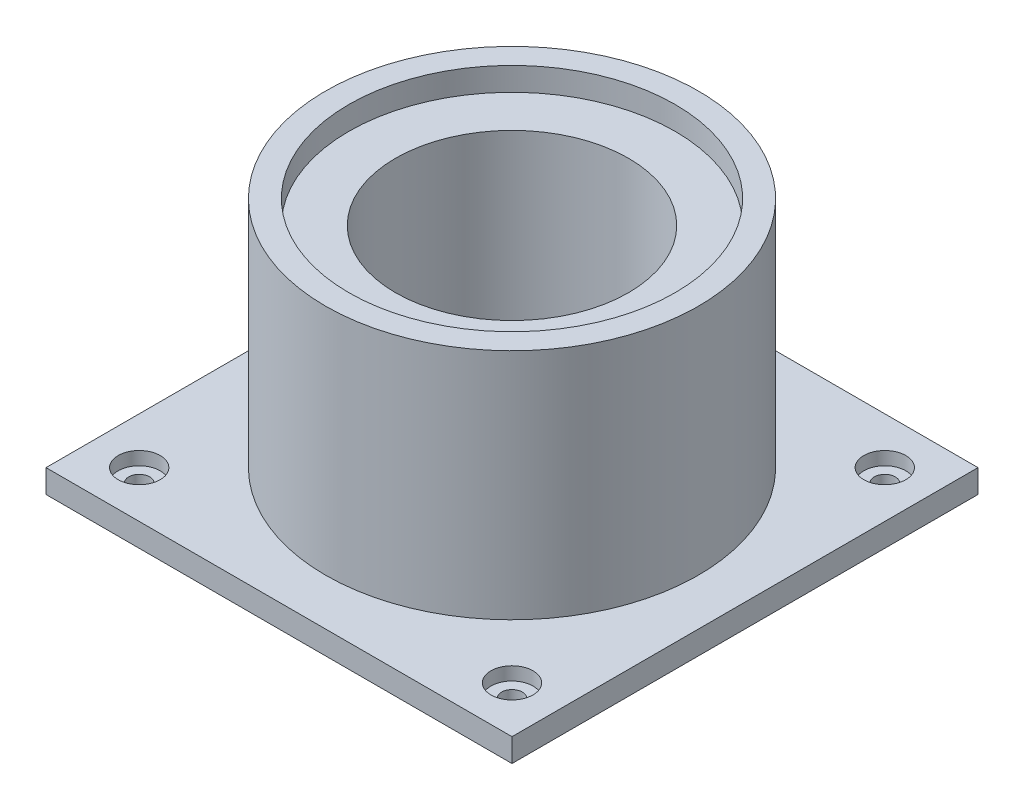
ISO-10303-21;
HEADER;
FILE_DESCRIPTION(('STEP AP214'),'2;1');
FILE_NAME('part.step','',(''),(''),'','','');
FILE_SCHEMA(('AUTOMOTIVE_DESIGN { 1 0 10303 214 1 1 1 1 }'));
ENDSEC;
DATA;
#1=APPLICATION_CONTEXT('core data for automotive mechanical design processes');
#2=APPLICATION_PROTOCOL_DEFINITION('international standard','automotive_design',2000,#1);
#3=PRODUCT_CONTEXT('',#1,'mechanical');
#4=PRODUCT('Part','Part','',(#3));
#5=PRODUCT_RELATED_PRODUCT_CATEGORY('part','',(#4));
#6=PRODUCT_DEFINITION_FORMATION('','',#4);
#7=PRODUCT_DEFINITION_CONTEXT('part definition',#1,'design');
#8=PRODUCT_DEFINITION('design','',#6,#7);
#9=PRODUCT_DEFINITION_SHAPE('','',#8);
#10=(LENGTH_UNIT() NAMED_UNIT(*) SI_UNIT(.MILLI.,.METRE.));
#11=(NAMED_UNIT(*) PLANE_ANGLE_UNIT() SI_UNIT($,.RADIAN.));
#12=(NAMED_UNIT(*) SI_UNIT($,.STERADIAN.) SOLID_ANGLE_UNIT());
#13=UNCERTAINTY_MEASURE_WITH_UNIT(LENGTH_MEASURE(1.E-05),#10,'distance_accuracy_value','');
#14=(GEOMETRIC_REPRESENTATION_CONTEXT(3) GLOBAL_UNCERTAINTY_ASSIGNED_CONTEXT((#13)) GLOBAL_UNIT_ASSIGNED_CONTEXT((#10,
#11,#12)) REPRESENTATION_CONTEXT('',''));
#15=CARTESIAN_POINT('',(0.,0.,0.));
#16=DIRECTION('',(0.,0.,1.));
#17=DIRECTION('',(1.,0.,0.));
#18=AXIS2_PLACEMENT_3D('',#15,#16,#17);
#19=CARTESIAN_POINT('',(-100.,10.,100.));
#20=DIRECTION('',(1.,0.,0.));
#21=DIRECTION('',(0.,0.,-1.));
#22=AXIS2_PLACEMENT_3D('',#19,#20,#21);
#23=PLANE('',#22);
#24=DIRECTION('',(0.,0.,1.));
#25=VECTOR('',#24,1.);
#26=CARTESIAN_POINT('',(-100.,0.,100.));
#27=LINE('',#26,#25);
#28=CARTESIAN_POINT('',(-100.,0.,-100.));
#29=VERTEX_POINT('',#28);
#30=CARTESIAN_POINT('',(-100.,0.,100.));
#31=VERTEX_POINT('',#30);
#32=EDGE_CURVE('E112',#29,#31,#27,.T.);
#33=ORIENTED_EDGE('',*,*,#32,.T.);
#34=DIRECTION('',(0.,-1.,0.));
#35=VECTOR('',#34,1.);
#36=CARTESIAN_POINT('',(-100.,10.,100.));
#37=LINE('',#36,#35);
#38=CARTESIAN_POINT('',(-100.,10.,100.));
#39=VERTEX_POINT('',#38);
#40=EDGE_CURVE('E49',#39,#31,#37,.T.);
#41=ORIENTED_EDGE('',*,*,#40,.F.);
#42=DIRECTION('',(0.,0.,1.));
#43=VECTOR('',#42,1.);
#44=CARTESIAN_POINT('',(-100.,10.,100.));
#45=LINE('',#44,#43);
#46=CARTESIAN_POINT('',(-100.,10.,-100.));
#47=VERTEX_POINT('',#46);
#48=EDGE_CURVE('E94',#47,#39,#45,.T.);
#49=ORIENTED_EDGE('',*,*,#48,.F.);
#50=DIRECTION('',(0.,-1.,0.));
#51=VECTOR('',#50,1.);
#52=CARTESIAN_POINT('',(-100.,10.,-100.));
#53=LINE('',#52,#51);
#54=EDGE_CURVE('E108',#47,#29,#53,.T.);
#55=ORIENTED_EDGE('',*,*,#54,.T.);
#56=EDGE_LOOP('',(#33,#41,#49,#55));
#57=FACE_BOUND('',#56,.T.);
#58=ADVANCED_FACE('F39',(#57),#23,.F.);
#59=CARTESIAN_POINT('',(100.,10.,100.));
#60=DIRECTION('',(0.,0.,-1.));
#61=DIRECTION('',(-1.,0.,0.));
#62=AXIS2_PLACEMENT_3D('',#59,#60,#61);
#63=PLANE('',#62);
#64=DIRECTION('',(1.,0.,0.));
#65=VECTOR('',#64,1.);
#66=CARTESIAN_POINT('',(100.,0.,100.));
#67=LINE('',#66,#65);
#68=CARTESIAN_POINT('',(100.,0.,100.));
#69=VERTEX_POINT('',#68);
#70=EDGE_CURVE('E100',#31,#69,#67,.T.);
#71=ORIENTED_EDGE('',*,*,#70,.T.);
#72=DIRECTION('',(0.,-1.,0.));
#73=VECTOR('',#72,1.);
#74=CARTESIAN_POINT('',(100.,10.,100.));
#75=LINE('',#74,#73);
#76=CARTESIAN_POINT('',(100.,10.,100.));
#77=VERTEX_POINT('',#76);
#78=EDGE_CURVE('E98',#77,#69,#75,.T.);
#79=ORIENTED_EDGE('',*,*,#78,.F.);
#80=DIRECTION('',(1.,0.,0.));
#81=VECTOR('',#80,1.);
#82=CARTESIAN_POINT('',(100.,10.,100.));
#83=LINE('',#82,#81);
#84=EDGE_CURVE('E89',#39,#77,#83,.T.);
#85=ORIENTED_EDGE('',*,*,#84,.F.);
#86=ORIENTED_EDGE('',*,*,#40,.T.);
#87=EDGE_LOOP('',(#71,#79,#85,#86));
#88=FACE_BOUND('',#87,.T.);
#89=ADVANCED_FACE('F99',(#88),#63,.F.);
#90=CARTESIAN_POINT('',(100.,10.,100.));
#91=DIRECTION('',(-1.,0.,0.));
#92=DIRECTION('',(0.,0.,1.));
#93=AXIS2_PLACEMENT_3D('',#90,#91,#92);
#94=PLANE('',#93);
#95=DIRECTION('',(0.,0.,-1.));
#96=VECTOR('',#95,1.);
#97=CARTESIAN_POINT('',(100.,0.,100.));
#98=LINE('',#97,#96);
#99=CARTESIAN_POINT('',(100.,0.,-100.));
#100=VERTEX_POINT('',#99);
#101=EDGE_CURVE('E75',#69,#100,#98,.T.);
#102=ORIENTED_EDGE('',*,*,#101,.T.);
#103=DIRECTION('',(0.,-1.,0.));
#104=VECTOR('',#103,1.);
#105=CARTESIAN_POINT('',(100.,10.,-100.));
#106=LINE('',#105,#104);
#107=CARTESIAN_POINT('',(100.,10.,-100.));
#108=VERTEX_POINT('',#107);
#109=EDGE_CURVE('E102',#108,#100,#106,.T.);
#110=ORIENTED_EDGE('',*,*,#109,.F.);
#111=DIRECTION('',(0.,0.,-1.));
#112=VECTOR('',#111,1.);
#113=CARTESIAN_POINT('',(100.,10.,100.));
#114=LINE('',#113,#112);
#115=EDGE_CURVE('E92',#77,#108,#114,.T.);
#116=ORIENTED_EDGE('',*,*,#115,.F.);
#117=ORIENTED_EDGE('',*,*,#78,.T.);
#118=EDGE_LOOP('',(#102,#110,#116,#117));
#119=FACE_BOUND('',#118,.T.);
#120=ADVANCED_FACE('F104',(#119),#94,.F.);
#121=CARTESIAN_POINT('',(100.,10.,-100.));
#122=DIRECTION('',(0.,0.,1.));
#123=DIRECTION('',(1.,0.,0.));
#124=AXIS2_PLACEMENT_3D('',#121,#122,#123);
#125=PLANE('',#124);
#126=DIRECTION('',(-1.,0.,0.));
#127=VECTOR('',#126,1.);
#128=CARTESIAN_POINT('',(100.,0.,-100.));
#129=LINE('',#128,#127);
#130=EDGE_CURVE('E81',#100,#29,#129,.T.);
#131=ORIENTED_EDGE('',*,*,#130,.T.);
#132=ORIENTED_EDGE('',*,*,#54,.F.);
#133=DIRECTION('',(-1.,0.,0.));
#134=VECTOR('',#133,1.);
#135=CARTESIAN_POINT('',(100.,10.,-100.));
#136=LINE('',#135,#134);
#137=EDGE_CURVE('E58',#108,#47,#136,.T.);
#138=ORIENTED_EDGE('',*,*,#137,.F.);
#139=ORIENTED_EDGE('',*,*,#109,.T.);
#140=EDGE_LOOP('',(#131,#132,#138,#139));
#141=FACE_BOUND('',#140,.T.);
#142=ADVANCED_FACE('F142',(#141),#125,.F.);
#143=CARTESIAN_POINT('',(0.,10.,0.));
#144=DIRECTION('',(0.,1.,0.));
#145=DIRECTION('',(0.,0.,1.));
#146=AXIS2_PLACEMENT_3D('',#143,#144,#145);
#147=PLANE('',#146);
#148=CARTESIAN_POINT('',(80.,10.,-80.));
#149=DIRECTION('',(0.,1.,0.));
#150=DIRECTION('',(0.,0.,1.));
#151=AXIS2_PLACEMENT_3D('',#148,#149,#150);
#152=CIRCLE('',#151,9.005);
#153=CARTESIAN_POINT('',(80.,10.,-70.995));
#154=VERTEX_POINT('',#153);
#155=EDGE_CURVE('E402',#154,#154,#152,.T.);
#156=ORIENTED_EDGE('',*,*,#155,.F.);
#157=EDGE_LOOP('',(#156));
#158=FACE_BOUND('',#157,.T.);
#159=CARTESIAN_POINT('',(-80.,10.,-80.));
#160=DIRECTION('',(0.,1.,0.));
#161=DIRECTION('',(0.,0.,1.));
#162=AXIS2_PLACEMENT_3D('',#159,#160,#161);
#163=CIRCLE('',#162,9.005);
#164=CARTESIAN_POINT('',(-80.,10.,-70.995));
#165=VERTEX_POINT('',#164);
#166=EDGE_CURVE('E387',#165,#165,#163,.T.);
#167=ORIENTED_EDGE('',*,*,#166,.F.);
#168=EDGE_LOOP('',(#167));
#169=FACE_BOUND('',#168,.T.);
#170=CARTESIAN_POINT('',(80.,10.,80.));
#171=DIRECTION('',(0.,1.,0.));
#172=DIRECTION('',(0.,0.,1.));
#173=AXIS2_PLACEMENT_3D('',#170,#171,#172);
#174=CIRCLE('',#173,9.005);
#175=CARTESIAN_POINT('',(80.,10.,89.005));
#176=VERTEX_POINT('',#175);
#177=EDGE_CURVE('E371',#176,#176,#174,.T.);
#178=ORIENTED_EDGE('',*,*,#177,.F.);
#179=EDGE_LOOP('',(#178));
#180=FACE_BOUND('',#179,.T.);
#181=CARTESIAN_POINT('',(-80.,10.,80.));
#182=DIRECTION('',(0.,1.,0.));
#183=DIRECTION('',(0.,0.,1.));
#184=AXIS2_PLACEMENT_3D('',#181,#182,#183);
#185=CIRCLE('',#184,9.005);
#186=CARTESIAN_POINT('',(-80.,10.,89.005));
#187=VERTEX_POINT('',#186);
#188=EDGE_CURVE('E355',#187,#187,#185,.T.);
#189=ORIENTED_EDGE('',*,*,#188,.F.);
#190=EDGE_LOOP('',(#189));
#191=FACE_BOUND('',#190,.T.);
#192=CARTESIAN_POINT('',(0.,10.,0.));
#193=DIRECTION('',(0.,1.,0.));
#194=DIRECTION('',(0.,0.,1.));
#195=AXIS2_PLACEMENT_3D('',#192,#193,#194);
#196=CIRCLE('',#195,80.);
#197=CARTESIAN_POINT('',(0.,10.,80.));
#198=VERTEX_POINT('',#197);
#199=EDGE_CURVE('E11',#198,#198,#196,.T.);
#200=ORIENTED_EDGE('',*,*,#199,.F.);
#201=EDGE_LOOP('',(#200));
#202=FACE_BOUND('',#201,.T.);
#203=ORIENTED_EDGE('',*,*,#48,.T.);
#204=ORIENTED_EDGE('',*,*,#84,.T.);
#205=ORIENTED_EDGE('',*,*,#115,.T.);
#206=ORIENTED_EDGE('',*,*,#137,.T.);
#207=EDGE_LOOP('',(#203,#204,#205,#206));
#208=FACE_BOUND('',#207,.T.);
#209=ADVANCED_FACE('F90',(#158,#169,#180,#191,#202,#208),#147,.T.);
#210=CARTESIAN_POINT('',(0.,0.,0.));
#211=DIRECTION('',(0.,1.,0.));
#212=DIRECTION('',(0.,0.,1.));
#213=AXIS2_PLACEMENT_3D('',#210,#211,#212);
#214=PLANE('',#213);
#215=CARTESIAN_POINT('',(80.,0.,-80.));
#216=DIRECTION('',(0.,1.,0.));
#217=DIRECTION('',(0.,0.,1.));
#218=AXIS2_PLACEMENT_3D('',#215,#216,#217);
#219=CIRCLE('',#218,4.5);
#220=CARTESIAN_POINT('',(80.,0.,-75.5));
#221=VERTEX_POINT('',#220);
#222=EDGE_CURVE('E391',#221,#221,#219,.T.);
#223=ORIENTED_EDGE('',*,*,#222,.T.);
#224=EDGE_LOOP('',(#223));
#225=FACE_BOUND('',#224,.T.);
#226=CARTESIAN_POINT('',(-80.,0.,-80.));
#227=DIRECTION('',(0.,1.,0.));
#228=DIRECTION('',(0.,0.,1.));
#229=AXIS2_PLACEMENT_3D('',#226,#227,#228);
#230=CIRCLE('',#229,4.5);
#231=CARTESIAN_POINT('',(-80.,0.,-75.5));
#232=VERTEX_POINT('',#231);
#233=EDGE_CURVE('E375',#232,#232,#230,.T.);
#234=ORIENTED_EDGE('',*,*,#233,.T.);
#235=EDGE_LOOP('',(#234));
#236=FACE_BOUND('',#235,.T.);
#237=CARTESIAN_POINT('',(80.,0.,80.));
#238=DIRECTION('',(0.,1.,0.));
#239=DIRECTION('',(0.,0.,1.));
#240=AXIS2_PLACEMENT_3D('',#237,#238,#239);
#241=CIRCLE('',#240,4.5);
#242=CARTESIAN_POINT('',(80.,0.,84.5));
#243=VERTEX_POINT('',#242);
#244=EDGE_CURVE('E359',#243,#243,#241,.T.);
#245=ORIENTED_EDGE('',*,*,#244,.T.);
#246=EDGE_LOOP('',(#245));
#247=FACE_BOUND('',#246,.T.);
#248=CARTESIAN_POINT('',(-80.,0.,80.));
#249=DIRECTION('',(0.,1.,0.));
#250=DIRECTION('',(0.,0.,1.));
#251=AXIS2_PLACEMENT_3D('',#248,#249,#250);
#252=CIRCLE('',#251,4.5);
#253=CARTESIAN_POINT('',(-80.,0.,84.5));
#254=VERTEX_POINT('',#253);
#255=EDGE_CURVE('E340',#254,#254,#252,.T.);
#256=ORIENTED_EDGE('',*,*,#255,.T.);
#257=EDGE_LOOP('',(#256));
#258=FACE_BOUND('',#257,.T.);
#259=ORIENTED_EDGE('',*,*,#32,.F.);
#260=ORIENTED_EDGE('',*,*,#130,.F.);
#261=ORIENTED_EDGE('',*,*,#101,.F.);
#262=ORIENTED_EDGE('',*,*,#70,.F.);
#263=EDGE_LOOP('',(#259,#260,#261,#262));
#264=FACE_BOUND('',#263,.T.);
#265=ADVANCED_FACE('F130',(#225,#236,#247,#258,#264),#214,.F.);
#266=CARTESIAN_POINT('',(0.,110.,0.));
#267=DIRECTION('',(0.,-1.,0.));
#268=DIRECTION('',(0.,0.,-1.));
#269=AXIS2_PLACEMENT_3D('',#266,#267,#268);
#270=CYLINDRICAL_SURFACE('',#269,80.);
#271=CARTESIAN_POINT('',(0.,110.,0.));
#272=DIRECTION('',(0.,1.,0.));
#273=DIRECTION('',(0.,0.,1.));
#274=AXIS2_PLACEMENT_3D('',#271,#272,#273);
#275=CIRCLE('',#274,80.);
#276=CARTESIAN_POINT('',(0.,110.,80.));
#277=VERTEX_POINT('',#276);
#278=EDGE_CURVE('E116',#277,#277,#275,.T.);
#279=ORIENTED_EDGE('',*,*,#278,.F.);
#280=EDGE_LOOP('',(#279));
#281=FACE_BOUND('',#280,.T.);
#282=ORIENTED_EDGE('',*,*,#199,.T.);
#283=EDGE_LOOP('',(#282));
#284=FACE_BOUND('',#283,.T.);
#285=ADVANCED_FACE('F132',(#281,#284),#270,.T.);
#286=CARTESIAN_POINT('',(0.,110.,0.));
#287=DIRECTION('',(0.,1.,0.));
#288=DIRECTION('',(0.,0.,1.));
#289=AXIS2_PLACEMENT_3D('',#286,#287,#288);
#290=PLANE('',#289);
#291=CARTESIAN_POINT('',(0.,110.,0.));
#292=DIRECTION('',(0.,1.,0.));
#293=DIRECTION('',(0.,0.,1.));
#294=AXIS2_PLACEMENT_3D('',#291,#292,#293);
#295=CIRCLE('',#294,70.);
#296=CARTESIAN_POINT('',(0.,110.,70.));
#297=VERTEX_POINT('',#296);
#298=EDGE_CURVE('E326',#297,#297,#295,.T.);
#299=ORIENTED_EDGE('',*,*,#298,.F.);
#300=EDGE_LOOP('',(#299));
#301=FACE_BOUND('',#300,.T.);
#302=ORIENTED_EDGE('',*,*,#278,.T.);
#303=EDGE_LOOP('',(#302));
#304=FACE_BOUND('',#303,.T.);
#305=ADVANCED_FACE('F139',(#301,#304),#290,.T.);
#306=CARTESIAN_POINT('',(0.,100.,0.));
#307=DIRECTION('',(0.,1.,0.));
#308=DIRECTION('',(0.,0.,1.));
#309=AXIS2_PLACEMENT_3D('',#306,#307,#308);
#310=PLANE('',#309);
#311=CARTESIAN_POINT('',(0.,100.,0.));
#312=DIRECTION('',(0.,1.,0.));
#313=DIRECTION('',(0.,0.,1.));
#314=AXIS2_PLACEMENT_3D('',#311,#312,#313);
#315=CIRCLE('',#314,70.);
#316=CARTESIAN_POINT('',(0.,100.,70.));
#317=VERTEX_POINT('',#316);
#318=EDGE_CURVE('E339',#317,#317,#315,.T.);
#319=ORIENTED_EDGE('',*,*,#318,.T.);
#320=EDGE_LOOP('',(#319));
#321=FACE_BOUND('',#320,.T.);
#322=CARTESIAN_POINT('',(0.,100.,0.));
#323=DIRECTION('',(0.,1.,0.));
#324=DIRECTION('',(0.,0.,1.));
#325=AXIS2_PLACEMENT_3D('',#322,#323,#324);
#326=CIRCLE('',#325,50.);
#327=CARTESIAN_POINT('',(0.,100.,50.));
#328=VERTEX_POINT('',#327);
#329=EDGE_CURVE('E42',#328,#328,#326,.F.);
#330=ORIENTED_EDGE('',*,*,#329,.T.);
#331=EDGE_LOOP('',(#330));
#332=FACE_BOUND('',#331,.T.);
#333=ADVANCED_FACE('F305',(#321,#332),#310,.T.);
#334=CARTESIAN_POINT('',(0.,100.,0.));
#335=DIRECTION('',(0.,1.,0.));
#336=DIRECTION('',(0.,0.,1.));
#337=AXIS2_PLACEMENT_3D('',#334,#335,#336);
#338=CYLINDRICAL_SURFACE('',#337,70.);
#339=ORIENTED_EDGE('',*,*,#318,.F.);
#340=EDGE_LOOP('',(#339));
#341=FACE_BOUND('',#340,.T.);
#342=ORIENTED_EDGE('',*,*,#298,.T.);
#343=EDGE_LOOP('',(#342));
#344=FACE_BOUND('',#343,.T.);
#345=ADVANCED_FACE('F308',(#341,#344),#338,.F.);
#346=CARTESIAN_POINT('',(0.,10.,0.));
#347=DIRECTION('',(0.,1.,0.));
#348=DIRECTION('',(0.,0.,1.));
#349=AXIS2_PLACEMENT_3D('',#346,#347,#348);
#350=PLANE('',#349);
#351=CARTESIAN_POINT('',(0.,10.,0.));
#352=DIRECTION('',(0.,1.,0.));
#353=DIRECTION('',(0.,0.,1.));
#354=AXIS2_PLACEMENT_3D('',#351,#352,#353);
#355=CIRCLE('',#354,50.);
#356=CARTESIAN_POINT('',(0.,10.,50.));
#357=VERTEX_POINT('',#356);
#358=EDGE_CURVE('E330',#357,#357,#355,.F.);
#359=ORIENTED_EDGE('',*,*,#358,.F.);
#360=EDGE_LOOP('',(#359));
#361=FACE_BOUND('',#360,.T.);
#362=ADVANCED_FACE('F312',(#361),#350,.T.);
#363=CARTESIAN_POINT('',(0.,-131.42135623731,0.));
#364=DIRECTION('',(0.,1.,0.));
#365=DIRECTION('',(0.,0.,1.));
#366=AXIS2_PLACEMENT_3D('',#363,#364,#365);
#367=CYLINDRICAL_SURFACE('',#366,50.);
#368=ORIENTED_EDGE('',*,*,#358,.T.);
#369=EDGE_LOOP('',(#368));
#370=FACE_BOUND('',#369,.T.);
#371=ORIENTED_EDGE('',*,*,#329,.F.);
#372=EDGE_LOOP('',(#371));
#373=FACE_BOUND('',#372,.T.);
#374=ADVANCED_FACE('F172',(#370,#373),#367,.F.);
#375=CARTESIAN_POINT('',(-80.,10.,80.));
#376=DIRECTION('',(0.,1.,0.));
#377=DIRECTION('',(0.,0.,1.));
#378=AXIS2_PLACEMENT_3D('',#375,#376,#377);
#379=CYLINDRICAL_SURFACE('',#378,4.5);
#380=ORIENTED_EDGE('',*,*,#255,.F.);
#381=EDGE_LOOP('',(#380));
#382=FACE_BOUND('',#381,.T.);
#383=CARTESIAN_POINT('',(-80.,4.32,80.));
#384=DIRECTION('',(0.,1.,0.));
#385=DIRECTION('',(0.,0.,1.));
#386=AXIS2_PLACEMENT_3D('',#383,#384,#385);
#387=CIRCLE('',#386,4.5);
#388=CARTESIAN_POINT('',(-80.,4.32,84.5));
#389=VERTEX_POINT('',#388);
#390=EDGE_CURVE('E347',#389,#389,#387,.T.);
#391=ORIENTED_EDGE('',*,*,#390,.T.);
#392=EDGE_LOOP('',(#391));
#393=FACE_BOUND('',#392,.T.);
#394=ADVANCED_FACE('F182',(#382,#393),#379,.F.);
#395=CARTESIAN_POINT('',(-75.5,4.32,80.));
#396=DIRECTION('',(0.,-1.,0.));
#397=DIRECTION('',(0.,0.,-1.));
#398=AXIS2_PLACEMENT_3D('',#395,#396,#397);
#399=PLANE('',#398);
#400=ORIENTED_EDGE('',*,*,#390,.F.);
#401=EDGE_LOOP('',(#400));
#402=FACE_BOUND('',#401,.T.);
#403=CARTESIAN_POINT('',(-80.,4.32,80.));
#404=DIRECTION('',(0.,1.,0.));
#405=DIRECTION('',(0.,0.,1.));
#406=AXIS2_PLACEMENT_3D('',#403,#404,#405);
#407=CIRCLE('',#406,9.005);
#408=CARTESIAN_POINT('',(-80.,4.32,89.005));
#409=VERTEX_POINT('',#408);
#410=EDGE_CURVE('E351',#409,#409,#407,.T.);
#411=ORIENTED_EDGE('',*,*,#410,.T.);
#412=EDGE_LOOP('',(#411));
#413=FACE_BOUND('',#412,.T.);
#414=ADVANCED_FACE('F187',(#402,#413),#399,.F.);
#415=CARTESIAN_POINT('',(-80.,10.,80.));
#416=DIRECTION('',(0.,1.,0.));
#417=DIRECTION('',(0.,0.,1.));
#418=AXIS2_PLACEMENT_3D('',#415,#416,#417);
#419=CYLINDRICAL_SURFACE('',#418,9.005);
#420=ORIENTED_EDGE('',*,*,#410,.F.);
#421=EDGE_LOOP('',(#420));
#422=FACE_BOUND('',#421,.T.);
#423=ORIENTED_EDGE('',*,*,#188,.T.);
#424=EDGE_LOOP('',(#423));
#425=FACE_BOUND('',#424,.T.);
#426=ADVANCED_FACE('F198',(#422,#425),#419,.F.);
#427=CARTESIAN_POINT('',(80.,10.,80.));
#428=DIRECTION('',(0.,1.,0.));
#429=DIRECTION('',(0.,0.,1.));
#430=AXIS2_PLACEMENT_3D('',#427,#428,#429);
#431=CYLINDRICAL_SURFACE('',#430,4.5);
#432=ORIENTED_EDGE('',*,*,#244,.F.);
#433=EDGE_LOOP('',(#432));
#434=FACE_BOUND('',#433,.T.);
#435=CARTESIAN_POINT('',(80.,4.32,80.));
#436=DIRECTION('',(0.,1.,0.));
#437=DIRECTION('',(0.,0.,1.));
#438=AXIS2_PLACEMENT_3D('',#435,#436,#437);
#439=CIRCLE('',#438,4.5);
#440=CARTESIAN_POINT('',(80.,4.32,84.5));
#441=VERTEX_POINT('',#440);
#442=EDGE_CURVE('E363',#441,#441,#439,.T.);
#443=ORIENTED_EDGE('',*,*,#442,.T.);
#444=EDGE_LOOP('',(#443));
#445=FACE_BOUND('',#444,.T.);
#446=ADVANCED_FACE('F208',(#434,#445),#431,.F.);
#447=CARTESIAN_POINT('',(84.5,4.32,80.));
#448=DIRECTION('',(0.,-1.,0.));
#449=DIRECTION('',(0.,0.,-1.));
#450=AXIS2_PLACEMENT_3D('',#447,#448,#449);
#451=PLANE('',#450);
#452=ORIENTED_EDGE('',*,*,#442,.F.);
#453=EDGE_LOOP('',(#452));
#454=FACE_BOUND('',#453,.T.);
#455=CARTESIAN_POINT('',(80.,4.32,80.));
#456=DIRECTION('',(0.,1.,0.));
#457=DIRECTION('',(0.,0.,1.));
#458=AXIS2_PLACEMENT_3D('',#455,#456,#457);
#459=CIRCLE('',#458,9.005);
#460=CARTESIAN_POINT('',(80.,4.32,89.005));
#461=VERTEX_POINT('',#460);
#462=EDGE_CURVE('E367',#461,#461,#459,.T.);
#463=ORIENTED_EDGE('',*,*,#462,.T.);
#464=EDGE_LOOP('',(#463));
#465=FACE_BOUND('',#464,.T.);
#466=ADVANCED_FACE('F218',(#454,#465),#451,.F.);
#467=CARTESIAN_POINT('',(80.,10.,80.));
#468=DIRECTION('',(0.,1.,0.));
#469=DIRECTION('',(0.,0.,1.));
#470=AXIS2_PLACEMENT_3D('',#467,#468,#469);
#471=CYLINDRICAL_SURFACE('',#470,9.005);
#472=ORIENTED_EDGE('',*,*,#462,.F.);
#473=EDGE_LOOP('',(#472));
#474=FACE_BOUND('',#473,.T.);
#475=ORIENTED_EDGE('',*,*,#177,.T.);
#476=EDGE_LOOP('',(#475));
#477=FACE_BOUND('',#476,.T.);
#478=ADVANCED_FACE('F228',(#474,#477),#471,.F.);
#479=CARTESIAN_POINT('',(-80.,10.,-80.));
#480=DIRECTION('',(0.,1.,0.));
#481=DIRECTION('',(0.,0.,1.));
#482=AXIS2_PLACEMENT_3D('',#479,#480,#481);
#483=CYLINDRICAL_SURFACE('',#482,4.5);
#484=ORIENTED_EDGE('',*,*,#233,.F.);
#485=EDGE_LOOP('',(#484));
#486=FACE_BOUND('',#485,.T.);
#487=CARTESIAN_POINT('',(-80.,4.32,-80.));
#488=DIRECTION('',(0.,1.,0.));
#489=DIRECTION('',(0.,0.,1.));
#490=AXIS2_PLACEMENT_3D('',#487,#488,#489);
#491=CIRCLE('',#490,4.5);
#492=CARTESIAN_POINT('',(-80.,4.32,-75.5));
#493=VERTEX_POINT('',#492);
#494=EDGE_CURVE('E379',#493,#493,#491,.T.);
#495=ORIENTED_EDGE('',*,*,#494,.T.);
#496=EDGE_LOOP('',(#495));
#497=FACE_BOUND('',#496,.T.);
#498=ADVANCED_FACE('F238',(#486,#497),#483,.F.);
#499=CARTESIAN_POINT('',(-75.5,4.32,-80.));
#500=DIRECTION('',(0.,-1.,0.));
#501=DIRECTION('',(0.,0.,-1.));
#502=AXIS2_PLACEMENT_3D('',#499,#500,#501);
#503=PLANE('',#502);
#504=ORIENTED_EDGE('',*,*,#494,.F.);
#505=EDGE_LOOP('',(#504));
#506=FACE_BOUND('',#505,.T.);
#507=CARTESIAN_POINT('',(-80.,4.32,-80.));
#508=DIRECTION('',(0.,1.,0.));
#509=DIRECTION('',(0.,0.,1.));
#510=AXIS2_PLACEMENT_3D('',#507,#508,#509);
#511=CIRCLE('',#510,9.005);
#512=CARTESIAN_POINT('',(-80.,4.32,-70.995));
#513=VERTEX_POINT('',#512);
#514=EDGE_CURVE('E383',#513,#513,#511,.T.);
#515=ORIENTED_EDGE('',*,*,#514,.T.);
#516=EDGE_LOOP('',(#515));
#517=FACE_BOUND('',#516,.T.);
#518=ADVANCED_FACE('F248',(#506,#517),#503,.F.);
#519=CARTESIAN_POINT('',(-80.,10.,-80.));
#520=DIRECTION('',(0.,1.,0.));
#521=DIRECTION('',(0.,0.,1.));
#522=AXIS2_PLACEMENT_3D('',#519,#520,#521);
#523=CYLINDRICAL_SURFACE('',#522,9.005);
#524=ORIENTED_EDGE('',*,*,#514,.F.);
#525=EDGE_LOOP('',(#524));
#526=FACE_BOUND('',#525,.T.);
#527=ORIENTED_EDGE('',*,*,#166,.T.);
#528=EDGE_LOOP('',(#527));
#529=FACE_BOUND('',#528,.T.);
#530=ADVANCED_FACE('F258',(#526,#529),#523,.F.);
#531=CARTESIAN_POINT('',(80.,10.,-80.));
#532=DIRECTION('',(0.,1.,0.));
#533=DIRECTION('',(0.,0.,1.));
#534=AXIS2_PLACEMENT_3D('',#531,#532,#533);
#535=CYLINDRICAL_SURFACE('',#534,4.5);
#536=ORIENTED_EDGE('',*,*,#222,.F.);
#537=EDGE_LOOP('',(#536));
#538=FACE_BOUND('',#537,.T.);
#539=CARTESIAN_POINT('',(80.,4.32,-80.));
#540=DIRECTION('',(0.,1.,0.));
#541=DIRECTION('',(0.,0.,1.));
#542=AXIS2_PLACEMENT_3D('',#539,#540,#541);
#543=CIRCLE('',#542,4.5);
#544=CARTESIAN_POINT('',(80.,4.32,-75.5));
#545=VERTEX_POINT('',#544);
#546=EDGE_CURVE('E394',#545,#545,#543,.T.);
#547=ORIENTED_EDGE('',*,*,#546,.T.);
#548=EDGE_LOOP('',(#547));
#549=FACE_BOUND('',#548,.T.);
#550=ADVANCED_FACE('F268',(#538,#549),#535,.F.);
#551=CARTESIAN_POINT('',(84.5,4.32,-80.));
#552=DIRECTION('',(0.,-1.,0.));
#553=DIRECTION('',(0.,0.,-1.));
#554=AXIS2_PLACEMENT_3D('',#551,#552,#553);
#555=PLANE('',#554);
#556=ORIENTED_EDGE('',*,*,#546,.F.);
#557=EDGE_LOOP('',(#556));
#558=FACE_BOUND('',#557,.T.);
#559=CARTESIAN_POINT('',(80.,4.32,-80.));
#560=DIRECTION('',(0.,1.,0.));
#561=DIRECTION('',(0.,0.,1.));
#562=AXIS2_PLACEMENT_3D('',#559,#560,#561);
#563=CIRCLE('',#562,9.005);
#564=CARTESIAN_POINT('',(80.,4.32,-70.995));
#565=VERTEX_POINT('',#564);
#566=EDGE_CURVE('E398',#565,#565,#563,.T.);
#567=ORIENTED_EDGE('',*,*,#566,.T.);
#568=EDGE_LOOP('',(#567));
#569=FACE_BOUND('',#568,.T.);
#570=ADVANCED_FACE('F278',(#558,#569),#555,.F.);
#571=CARTESIAN_POINT('',(80.,10.,-80.));
#572=DIRECTION('',(0.,1.,0.));
#573=DIRECTION('',(0.,0.,1.));
#574=AXIS2_PLACEMENT_3D('',#571,#572,#573);
#575=CYLINDRICAL_SURFACE('',#574,9.005);
#576=ORIENTED_EDGE('',*,*,#566,.F.);
#577=EDGE_LOOP('',(#576));
#578=FACE_BOUND('',#577,.T.);
#579=ORIENTED_EDGE('',*,*,#155,.T.);
#580=EDGE_LOOP('',(#579));
#581=FACE_BOUND('',#580,.T.);
#582=ADVANCED_FACE('F288',(#578,#581),#575,.F.);
#583=CLOSED_SHELL('',(#58,#89,#120,#142,#209,#265,#285,#305,#333,#345,#362,#374,#394,#414,#426,
#446,#466,#478,#498,#518,#530,#550,#570,#582));
#584=MANIFOLD_SOLID_BREP('B2',#583);
#585=ADVANCED_BREP_SHAPE_REPRESENTATION('',(#18,#584),#14);
#586=SHAPE_DEFINITION_REPRESENTATION(#9,#585);
ENDSEC;
END-ISO-10303-21;
